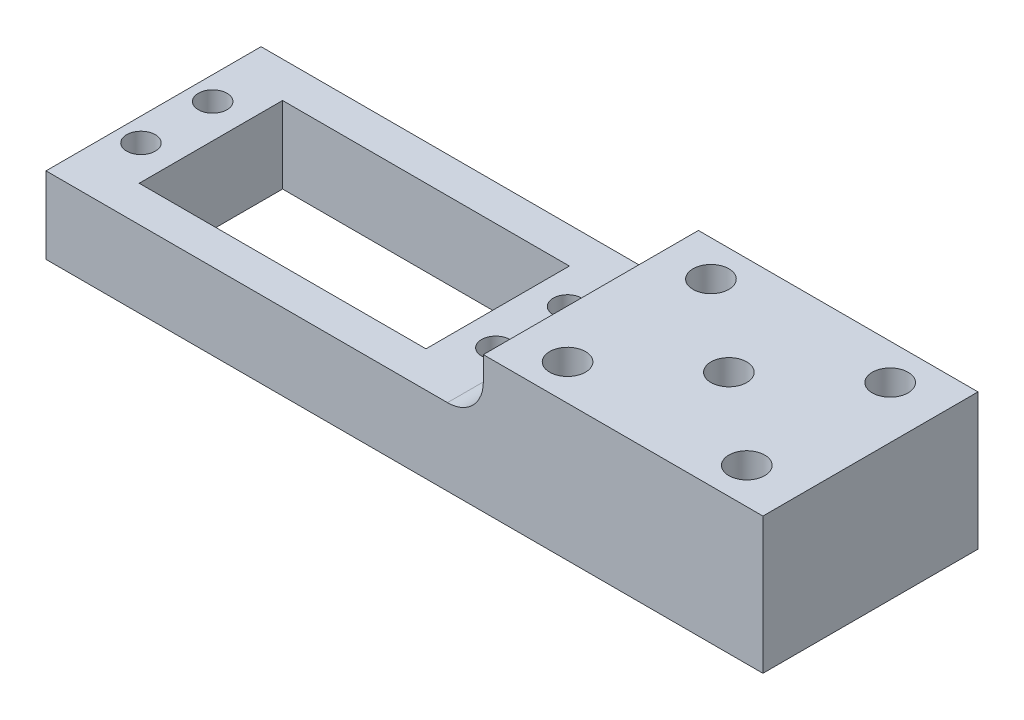
ISO-10303-21;
HEADER;
FILE_DESCRIPTION(('STEP AP214'),'2;1');
FILE_NAME('part.step','',(''),(''),'','','');
FILE_SCHEMA(('AUTOMOTIVE_DESIGN { 1 0 10303 214 1 1 1 1 }'));
ENDSEC;
DATA;
#1=APPLICATION_CONTEXT('core data for automotive mechanical design processes');
#2=APPLICATION_PROTOCOL_DEFINITION('international standard','automotive_design',2000,#1);
#3=PRODUCT_CONTEXT('',#1,'mechanical');
#4=PRODUCT('Part','Part','',(#3));
#5=PRODUCT_RELATED_PRODUCT_CATEGORY('part','',(#4));
#6=PRODUCT_DEFINITION_FORMATION('','',#4);
#7=PRODUCT_DEFINITION_CONTEXT('part definition',#1,'design');
#8=PRODUCT_DEFINITION('design','',#6,#7);
#9=PRODUCT_DEFINITION_SHAPE('','',#8);
#10=(LENGTH_UNIT() NAMED_UNIT(*) SI_UNIT(.MILLI.,.METRE.));
#11=(NAMED_UNIT(*) PLANE_ANGLE_UNIT() SI_UNIT($,.RADIAN.));
#12=(NAMED_UNIT(*) SI_UNIT($,.STERADIAN.) SOLID_ANGLE_UNIT());
#13=UNCERTAINTY_MEASURE_WITH_UNIT(LENGTH_MEASURE(1.E-05),#10,'distance_accuracy_value','');
#14=(GEOMETRIC_REPRESENTATION_CONTEXT(3) GLOBAL_UNCERTAINTY_ASSIGNED_CONTEXT((#13)) GLOBAL_UNIT_ASSIGNED_CONTEXT((#10,
#11,#12)) REPRESENTATION_CONTEXT('',''));
#15=CARTESIAN_POINT('',(0.,0.,0.));
#16=DIRECTION('',(0.,0.,1.));
#17=DIRECTION('',(1.,0.,0.));
#18=AXIS2_PLACEMENT_3D('',#15,#16,#17);
#19=CARTESIAN_POINT('',(0.,10.7,-10.));
#20=DIRECTION('',(0.,0.,-1.));
#21=DIRECTION('',(-1.,0.,0.));
#22=AXIS2_PLACEMENT_3D('',#19,#20,#21);
#23=PLANE('',#22);
#24=DIRECTION('',(1.,0.,0.));
#25=VECTOR('',#24,1.);
#26=CARTESIAN_POINT('',(0.,0.,-10.));
#27=LINE('',#26,#25);
#28=CARTESIAN_POINT('',(-20.,0.,-10.));
#29=VERTEX_POINT('',#28);
#30=CARTESIAN_POINT('',(20.,0.,-10.));
#31=VERTEX_POINT('',#30);
#32=EDGE_CURVE('E398',#29,#31,#27,.T.);
#33=ORIENTED_EDGE('',*,*,#32,.T.);
#34=DIRECTION('',(0.,-1.,0.));
#35=VECTOR('',#34,1.);
#36=CARTESIAN_POINT('',(20.,10.7,-10.));
#37=LINE('',#36,#35);
#38=CARTESIAN_POINT('',(20.,10.7,-10.));
#39=VERTEX_POINT('',#38);
#40=EDGE_CURVE('E273',#39,#31,#37,.T.);
#41=ORIENTED_EDGE('',*,*,#40,.F.);
#42=DIRECTION('',(1.,0.,0.));
#43=VECTOR('',#42,1.);
#44=CARTESIAN_POINT('',(0.,10.7,-10.));
#45=LINE('',#44,#43);
#46=CARTESIAN_POINT('',(-20.,10.7,-10.));
#47=VERTEX_POINT('',#46);
#48=EDGE_CURVE('E361',#47,#39,#45,.T.);
#49=ORIENTED_EDGE('',*,*,#48,.F.);
#50=DIRECTION('',(0.,-1.,0.));
#51=VECTOR('',#50,1.);
#52=CARTESIAN_POINT('',(-20.,10.7,-10.));
#53=LINE('',#52,#51);
#54=EDGE_CURVE('E278',#47,#29,#53,.T.);
#55=ORIENTED_EDGE('',*,*,#54,.T.);
#56=EDGE_LOOP('',(#33,#41,#49,#55));
#57=FACE_BOUND('',#56,.T.);
#58=ADVANCED_FACE('F72',(#57),#23,.F.);
#59=CARTESIAN_POINT('',(20.,10.7,0.));
#60=DIRECTION('',(1.,0.,0.));
#61=DIRECTION('',(0.,0.,-1.));
#62=AXIS2_PLACEMENT_3D('',#59,#60,#61);
#63=PLANE('',#62);
#64=DIRECTION('',(0.,0.,1.));
#65=VECTOR('',#64,1.);
#66=CARTESIAN_POINT('',(20.,0.,0.));
#67=LINE('',#66,#65);
#68=CARTESIAN_POINT('',(20.,0.,10.));
#69=VERTEX_POINT('',#68);
#70=EDGE_CURVE('E413',#31,#69,#67,.T.);
#71=ORIENTED_EDGE('',*,*,#70,.T.);
#72=DIRECTION('',(0.,-1.,0.));
#73=VECTOR('',#72,1.);
#74=CARTESIAN_POINT('',(20.,10.7,10.));
#75=LINE('',#74,#73);
#76=CARTESIAN_POINT('',(20.,10.7,10.));
#77=VERTEX_POINT('',#76);
#78=EDGE_CURVE('E379',#77,#69,#75,.T.);
#79=ORIENTED_EDGE('',*,*,#78,.F.);
#80=DIRECTION('',(0.,0.,1.));
#81=VECTOR('',#80,1.);
#82=CARTESIAN_POINT('',(20.,10.7,0.));
#83=LINE('',#82,#81);
#84=EDGE_CURVE('E365',#39,#77,#83,.T.);
#85=ORIENTED_EDGE('',*,*,#84,.F.);
#86=ORIENTED_EDGE('',*,*,#40,.T.);
#87=EDGE_LOOP('',(#71,#79,#85,#86));
#88=FACE_BOUND('',#87,.T.);
#89=ADVANCED_FACE('F447',(#88),#63,.F.);
#90=CARTESIAN_POINT('',(0.,10.7,10.));
#91=DIRECTION('',(0.,0.,-1.));
#92=DIRECTION('',(-1.,0.,0.));
#93=AXIS2_PLACEMENT_3D('',#90,#91,#92);
#94=PLANE('',#93);
#95=DIRECTION('',(1.,0.,0.));
#96=VECTOR('',#95,1.);
#97=CARTESIAN_POINT('',(0.,0.,10.));
#98=LINE('',#97,#96);
#99=CARTESIAN_POINT('',(-20.,0.,10.));
#100=VERTEX_POINT('',#99);
#101=EDGE_CURVE('E417',#100,#69,#98,.T.);
#102=ORIENTED_EDGE('',*,*,#101,.F.);
#103=DIRECTION('',(0.,-1.,0.));
#104=VECTOR('',#103,1.);
#105=CARTESIAN_POINT('',(-20.,10.7,10.));
#106=LINE('',#105,#104);
#107=CARTESIAN_POINT('',(-20.,10.7,10.));
#108=VERTEX_POINT('',#107);
#109=EDGE_CURVE('E381',#108,#100,#106,.T.);
#110=ORIENTED_EDGE('',*,*,#109,.F.);
#111=DIRECTION('',(1.,0.,0.));
#112=VECTOR('',#111,1.);
#113=CARTESIAN_POINT('',(0.,10.7,10.));
#114=LINE('',#113,#112);
#115=EDGE_CURVE('E319',#108,#77,#114,.T.);
#116=ORIENTED_EDGE('',*,*,#115,.T.);
#117=ORIENTED_EDGE('',*,*,#78,.T.);
#118=EDGE_LOOP('',(#102,#110,#116,#117));
#119=FACE_BOUND('',#118,.T.);
#120=ADVANCED_FACE('F378',(#119),#94,.T.);
#121=CARTESIAN_POINT('',(0.,10.7,-15.));
#122=DIRECTION('',(0.,0.,-1.));
#123=DIRECTION('',(-1.,0.,0.));
#124=AXIS2_PLACEMENT_3D('',#121,#122,#123);
#125=PLANE('',#124);
#126=DIRECTION('',(1.,0.,0.));
#127=VECTOR('',#126,1.);
#128=CARTESIAN_POINT('',(0.,0.,-15.));
#129=LINE('',#128,#127);
#130=CARTESIAN_POINT('',(-28.,0.,-15.));
#131=VERTEX_POINT('',#130);
#132=CARTESIAN_POINT('',(72.,0.,-15.));
#133=VERTEX_POINT('',#132);
#134=EDGE_CURVE('E178',#131,#133,#129,.T.);
#135=ORIENTED_EDGE('',*,*,#134,.F.);
#136=DIRECTION('',(0.,-1.,0.));
#137=VECTOR('',#136,1.);
#138=CARTESIAN_POINT('',(-28.,10.7,-15.));
#139=LINE('',#138,#137);
#140=CARTESIAN_POINT('',(-28.,10.7,-15.));
#141=VERTEX_POINT('',#140);
#142=EDGE_CURVE('E274',#141,#131,#139,.T.);
#143=ORIENTED_EDGE('',*,*,#142,.F.);
#144=DIRECTION('',(1.,0.,0.));
#145=VECTOR('',#144,1.);
#146=CARTESIAN_POINT('',(0.,10.7,-15.));
#147=LINE('',#146,#145);
#148=CARTESIAN_POINT('',(28.,10.7,-15.));
#149=VERTEX_POINT('',#148);
#150=EDGE_CURVE('E357',#141,#149,#147,.T.);
#151=ORIENTED_EDGE('',*,*,#150,.T.);
#152=CARTESIAN_POINT('',(28.,15.7,-15.));
#153=DIRECTION('',(0.,0.,-1.));
#154=DIRECTION('',(-1.,0.,0.));
#155=AXIS2_PLACEMENT_3D('',#152,#153,#154);
#156=CIRCLE('',#155,5.);
#157=CARTESIAN_POINT('',(33.,15.7,-15.));
#158=VERTEX_POINT('',#157);
#159=EDGE_CURVE('E13',#149,#158,#156,.F.);
#160=ORIENTED_EDGE('',*,*,#159,.T.);
#161=DIRECTION('',(0.,-1.,0.));
#162=VECTOR('',#161,1.);
#163=CARTESIAN_POINT('',(33.,19.,-15.));
#164=LINE('',#163,#162);
#165=CARTESIAN_POINT('',(33.,19.,-15.));
#166=VERTEX_POINT('',#165);
#167=EDGE_CURVE('E200',#166,#158,#164,.T.);
#168=ORIENTED_EDGE('',*,*,#167,.F.);
#169=DIRECTION('',(1.,0.,0.));
#170=VECTOR('',#169,1.);
#171=CARTESIAN_POINT('',(-28.,19.,-15.));
#172=LINE('',#171,#170);
#173=CARTESIAN_POINT('',(72.,19.,-15.));
#174=VERTEX_POINT('',#173);
#175=EDGE_CURVE('E195',#166,#174,#172,.T.);
#176=ORIENTED_EDGE('',*,*,#175,.T.);
#177=DIRECTION('',(0.,-1.,0.));
#178=VECTOR('',#177,1.);
#179=CARTESIAN_POINT('',(72.,19.,-15.));
#180=LINE('',#179,#178);
#181=EDGE_CURVE('E191',#174,#133,#180,.T.);
#182=ORIENTED_EDGE('',*,*,#181,.T.);
#183=EDGE_LOOP('',(#135,#143,#151,#160,#168,#176,#182));
#184=FACE_BOUND('',#183,.T.);
#185=ADVANCED_FACE('F192',(#184),#125,.T.);
#186=CARTESIAN_POINT('',(-28.,10.7,0.));
#187=DIRECTION('',(1.,0.,0.));
#188=DIRECTION('',(0.,0.,-1.));
#189=AXIS2_PLACEMENT_3D('',#186,#187,#188);
#190=PLANE('',#189);
#191=DIRECTION('',(0.,0.,1.));
#192=VECTOR('',#191,1.);
#193=CARTESIAN_POINT('',(-28.,0.,0.));
#194=LINE('',#193,#192);
#195=CARTESIAN_POINT('',(-28.,0.,15.));
#196=VERTEX_POINT('',#195);
#197=EDGE_CURVE('E185',#131,#196,#194,.T.);
#198=ORIENTED_EDGE('',*,*,#197,.T.);
#199=DIRECTION('',(0.,-1.,0.));
#200=VECTOR('',#199,1.);
#201=CARTESIAN_POINT('',(-28.,10.7,15.));
#202=LINE('',#201,#200);
#203=CARTESIAN_POINT('',(-28.,10.7,15.));
#204=VERTEX_POINT('',#203);
#205=EDGE_CURVE('E279',#204,#196,#202,.T.);
#206=ORIENTED_EDGE('',*,*,#205,.F.);
#207=DIRECTION('',(0.,0.,1.));
#208=VECTOR('',#207,1.);
#209=CARTESIAN_POINT('',(-28.,10.7,0.));
#210=LINE('',#209,#208);
#211=EDGE_CURVE('E351',#141,#204,#210,.T.);
#212=ORIENTED_EDGE('',*,*,#211,.F.);
#213=ORIENTED_EDGE('',*,*,#142,.T.);
#214=EDGE_LOOP('',(#198,#206,#212,#213));
#215=FACE_BOUND('',#214,.T.);
#216=ADVANCED_FACE('F459',(#215),#190,.F.);
#217=CARTESIAN_POINT('',(-20.,10.7,0.));
#218=DIRECTION('',(1.,0.,0.));
#219=DIRECTION('',(0.,0.,-1.));
#220=AXIS2_PLACEMENT_3D('',#217,#218,#219);
#221=PLANE('',#220);
#222=DIRECTION('',(0.,0.,1.));
#223=VECTOR('',#222,1.);
#224=CARTESIAN_POINT('',(-20.,0.,0.));
#225=LINE('',#224,#223);
#226=EDGE_CURVE('E390',#29,#100,#225,.T.);
#227=ORIENTED_EDGE('',*,*,#226,.F.);
#228=ORIENTED_EDGE('',*,*,#54,.F.);
#229=DIRECTION('',(0.,0.,1.));
#230=VECTOR('',#229,1.);
#231=CARTESIAN_POINT('',(-20.,10.7,0.));
#232=LINE('',#231,#230);
#233=EDGE_CURVE('E314',#47,#108,#232,.T.);
#234=ORIENTED_EDGE('',*,*,#233,.T.);
#235=ORIENTED_EDGE('',*,*,#109,.T.);
#236=EDGE_LOOP('',(#227,#228,#234,#235));
#237=FACE_BOUND('',#236,.T.);
#238=ADVANCED_FACE('F387',(#237),#221,.T.);
#239=CARTESIAN_POINT('',(0.,10.7,15.));
#240=DIRECTION('',(0.,0.,-1.));
#241=DIRECTION('',(-1.,0.,0.));
#242=AXIS2_PLACEMENT_3D('',#239,#240,#241);
#243=PLANE('',#242);
#244=DIRECTION('',(1.,0.,0.));
#245=VECTOR('',#244,1.);
#246=CARTESIAN_POINT('',(0.,0.,15.));
#247=LINE('',#246,#245);
#248=CARTESIAN_POINT('',(72.,0.,15.));
#249=VERTEX_POINT('',#248);
#250=EDGE_CURVE('E290',#196,#249,#247,.T.);
#251=ORIENTED_EDGE('',*,*,#250,.T.);
#252=DIRECTION('',(0.,-1.,0.));
#253=VECTOR('',#252,1.);
#254=CARTESIAN_POINT('',(72.,19.,15.));
#255=LINE('',#254,#253);
#256=CARTESIAN_POINT('',(72.,19.,15.));
#257=VERTEX_POINT('',#256);
#258=EDGE_CURVE('E205',#257,#249,#255,.T.);
#259=ORIENTED_EDGE('',*,*,#258,.F.);
#260=DIRECTION('',(1.,0.,0.));
#261=VECTOR('',#260,1.);
#262=CARTESIAN_POINT('',(-28.,19.,15.));
#263=LINE('',#262,#261);
#264=CARTESIAN_POINT('',(33.,19.,15.));
#265=VERTEX_POINT('',#264);
#266=EDGE_CURVE('E208',#265,#257,#263,.T.);
#267=ORIENTED_EDGE('',*,*,#266,.F.);
#268=DIRECTION('',(0.,-1.,0.));
#269=VECTOR('',#268,1.);
#270=CARTESIAN_POINT('',(33.,19.,15.));
#271=LINE('',#270,#269);
#272=CARTESIAN_POINT('',(33.,15.7,15.));
#273=VERTEX_POINT('',#272);
#274=EDGE_CURVE('E207',#265,#273,#271,.T.);
#275=ORIENTED_EDGE('',*,*,#274,.T.);
#276=CARTESIAN_POINT('',(28.,15.7,15.));
#277=DIRECTION('',(0.,0.,-1.));
#278=DIRECTION('',(-1.,0.,0.));
#279=AXIS2_PLACEMENT_3D('',#276,#277,#278);
#280=CIRCLE('',#279,5.);
#281=CARTESIAN_POINT('',(28.,10.7,15.));
#282=VERTEX_POINT('',#281);
#283=EDGE_CURVE('E81',#273,#282,#280,.T.);
#284=ORIENTED_EDGE('',*,*,#283,.T.);
#285=DIRECTION('',(1.,0.,0.));
#286=VECTOR('',#285,1.);
#287=CARTESIAN_POINT('',(0.,10.7,15.));
#288=LINE('',#287,#286);
#289=EDGE_CURVE('E356',#204,#282,#288,.T.);
#290=ORIENTED_EDGE('',*,*,#289,.F.);
#291=ORIENTED_EDGE('',*,*,#205,.T.);
#292=EDGE_LOOP('',(#251,#259,#267,#275,#284,#290,#291));
#293=FACE_BOUND('',#292,.T.);
#294=ADVANCED_FACE('F455',(#293),#243,.F.);
#295=CARTESIAN_POINT('',(24.7500000000039,10.7,-5.));
#296=DIRECTION('',(0.,-1.,0.));
#297=DIRECTION('',(0.,0.,-1.));
#298=AXIS2_PLACEMENT_3D('',#295,#296,#297);
#299=CYLINDRICAL_SURFACE('',#298,2.);
#300=CARTESIAN_POINT('',(24.7500000000039,10.7,-5.));
#301=DIRECTION('',(0.,1.,0.));
#302=DIRECTION('',(0.,0.,1.));
#303=AXIS2_PLACEMENT_3D('',#300,#301,#302);
#304=CIRCLE('',#303,2.);
#305=CARTESIAN_POINT('',(24.7500000000039,10.7,-3.));
#306=VERTEX_POINT('',#305);
#307=EDGE_CURVE('E342',#306,#306,#304,.T.);
#308=ORIENTED_EDGE('',*,*,#307,.T.);
#309=EDGE_LOOP('',(#308));
#310=FACE_BOUND('',#309,.T.);
#311=CARTESIAN_POINT('',(24.7500000000039,0.,-5.));
#312=DIRECTION('',(0.,1.,0.));
#313=DIRECTION('',(0.,0.,1.));
#314=AXIS2_PLACEMENT_3D('',#311,#312,#313);
#315=CIRCLE('',#314,2.);
#316=CARTESIAN_POINT('',(24.7500000000039,0.,-3.));
#317=VERTEX_POINT('',#316);
#318=EDGE_CURVE('E188',#317,#317,#315,.T.);
#319=ORIENTED_EDGE('',*,*,#318,.F.);
#320=EDGE_LOOP('',(#319));
#321=FACE_BOUND('',#320,.T.);
#322=ADVANCED_FACE('F458',(#310,#321),#299,.F.);
#323=CARTESIAN_POINT('',(24.7500000000039,10.7,5.));
#324=DIRECTION('',(0.,-1.,0.));
#325=DIRECTION('',(0.,0.,-1.));
#326=AXIS2_PLACEMENT_3D('',#323,#324,#325);
#327=CYLINDRICAL_SURFACE('',#326,2.);
#328=CARTESIAN_POINT('',(24.7500000000039,10.7,5.));
#329=DIRECTION('',(0.,1.,0.));
#330=DIRECTION('',(0.,0.,1.));
#331=AXIS2_PLACEMENT_3D('',#328,#329,#330);
#332=CIRCLE('',#331,2.);
#333=CARTESIAN_POINT('',(24.7500000000039,10.7,7.));
#334=VERTEX_POINT('',#333);
#335=EDGE_CURVE('E336',#334,#334,#332,.T.);
#336=ORIENTED_EDGE('',*,*,#335,.T.);
#337=EDGE_LOOP('',(#336));
#338=FACE_BOUND('',#337,.T.);
#339=CARTESIAN_POINT('',(24.7500000000039,0.,5.));
#340=DIRECTION('',(0.,1.,0.));
#341=DIRECTION('',(0.,0.,1.));
#342=AXIS2_PLACEMENT_3D('',#339,#340,#341);
#343=CIRCLE('',#342,2.);
#344=CARTESIAN_POINT('',(24.7500000000039,0.,7.));
#345=VERTEX_POINT('',#344);
#346=EDGE_CURVE('E302',#345,#345,#343,.T.);
#347=ORIENTED_EDGE('',*,*,#346,.F.);
#348=EDGE_LOOP('',(#347));
#349=FACE_BOUND('',#348,.T.);
#350=ADVANCED_FACE('F467',(#338,#349),#327,.F.);
#351=CARTESIAN_POINT('',(-24.7500000000038,10.7,5.));
#352=DIRECTION('',(0.,-1.,0.));
#353=DIRECTION('',(0.,0.,-1.));
#354=AXIS2_PLACEMENT_3D('',#351,#352,#353);
#355=CYLINDRICAL_SURFACE('',#354,2.);
#356=CARTESIAN_POINT('',(-24.7500000000038,10.7,5.));
#357=DIRECTION('',(0.,1.,0.));
#358=DIRECTION('',(0.,0.,1.));
#359=AXIS2_PLACEMENT_3D('',#356,#357,#358);
#360=CIRCLE('',#359,2.);
#361=CARTESIAN_POINT('',(-24.7500000000038,10.7,7.));
#362=VERTEX_POINT('',#361);
#363=EDGE_CURVE('E332',#362,#362,#360,.F.);
#364=ORIENTED_EDGE('',*,*,#363,.F.);
#365=EDGE_LOOP('',(#364));
#366=FACE_BOUND('',#365,.T.);
#367=CARTESIAN_POINT('',(-24.7500000000038,0.,5.));
#368=DIRECTION('',(0.,1.,0.));
#369=DIRECTION('',(0.,0.,1.));
#370=AXIS2_PLACEMENT_3D('',#367,#368,#369);
#371=CIRCLE('',#370,2.);
#372=CARTESIAN_POINT('',(-24.7500000000038,0.,7.));
#373=VERTEX_POINT('',#372);
#374=EDGE_CURVE('E254',#373,#373,#371,.F.);
#375=ORIENTED_EDGE('',*,*,#374,.T.);
#376=EDGE_LOOP('',(#375));
#377=FACE_BOUND('',#376,.T.);
#378=ADVANCED_FACE('F470',(#366,#377),#355,.F.);
#379=CARTESIAN_POINT('',(-24.7500000000038,10.7,-5.));
#380=DIRECTION('',(0.,-1.,0.));
#381=DIRECTION('',(0.,0.,-1.));
#382=AXIS2_PLACEMENT_3D('',#379,#380,#381);
#383=CYLINDRICAL_SURFACE('',#382,2.);
#384=CARTESIAN_POINT('',(-24.7500000000038,10.7,-5.));
#385=DIRECTION('',(0.,1.,0.));
#386=DIRECTION('',(0.,0.,1.));
#387=AXIS2_PLACEMENT_3D('',#384,#385,#386);
#388=CIRCLE('',#387,2.);
#389=CARTESIAN_POINT('',(-24.7500000000038,10.7,-3.));
#390=VERTEX_POINT('',#389);
#391=EDGE_CURVE('E310',#390,#390,#388,.F.);
#392=ORIENTED_EDGE('',*,*,#391,.F.);
#393=EDGE_LOOP('',(#392));
#394=FACE_BOUND('',#393,.T.);
#395=CARTESIAN_POINT('',(-24.7500000000038,0.,-5.));
#396=DIRECTION('',(0.,1.,0.));
#397=DIRECTION('',(0.,0.,1.));
#398=AXIS2_PLACEMENT_3D('',#395,#396,#397);
#399=CIRCLE('',#398,2.);
#400=CARTESIAN_POINT('',(-24.7500000000038,0.,-3.));
#401=VERTEX_POINT('',#400);
#402=EDGE_CURVE('E337',#401,#401,#399,.F.);
#403=ORIENTED_EDGE('',*,*,#402,.T.);
#404=EDGE_LOOP('',(#403));
#405=FACE_BOUND('',#404,.T.);
#406=ADVANCED_FACE('F428',(#394,#405),#383,.F.);
#407=CARTESIAN_POINT('',(0.,10.7,0.));
#408=DIRECTION('',(0.,1.,0.));
#409=DIRECTION('',(0.,0.,1.));
#410=AXIS2_PLACEMENT_3D('',#407,#408,#409);
#411=PLANE('',#410);
#412=ORIENTED_EDGE('',*,*,#363,.T.);
#413=EDGE_LOOP('',(#412));
#414=FACE_BOUND('',#413,.T.);
#415=ORIENTED_EDGE('',*,*,#335,.F.);
#416=EDGE_LOOP('',(#415));
#417=FACE_BOUND('',#416,.T.);
#418=ORIENTED_EDGE('',*,*,#307,.F.);
#419=EDGE_LOOP('',(#418));
#420=FACE_BOUND('',#419,.T.);
#421=ORIENTED_EDGE('',*,*,#289,.T.);
#422=DIRECTION('',(0.,0.,1.));
#423=VECTOR('',#422,1.);
#424=CARTESIAN_POINT('',(28.,10.7,0.));
#425=LINE('',#424,#423);
#426=EDGE_CURVE('E99',#282,#149,#425,.F.);
#427=ORIENTED_EDGE('',*,*,#426,.T.);
#428=ORIENTED_EDGE('',*,*,#150,.F.);
#429=ORIENTED_EDGE('',*,*,#211,.T.);
#430=EDGE_LOOP('',(#421,#427,#428,#429));
#431=FACE_BOUND('',#430,.T.);
#432=ORIENTED_EDGE('',*,*,#48,.T.);
#433=ORIENTED_EDGE('',*,*,#84,.T.);
#434=ORIENTED_EDGE('',*,*,#115,.F.);
#435=ORIENTED_EDGE('',*,*,#233,.F.);
#436=EDGE_LOOP('',(#432,#433,#434,#435));
#437=FACE_BOUND('',#436,.T.);
#438=ORIENTED_EDGE('',*,*,#391,.T.);
#439=EDGE_LOOP('',(#438));
#440=FACE_BOUND('',#439,.T.);
#441=ADVANCED_FACE('F383',(#414,#417,#420,#431,#437,#440),#411,.T.);
#442=CARTESIAN_POINT('',(0.,0.,0.));
#443=DIRECTION('',(0.,1.,0.));
#444=DIRECTION('',(0.,0.,1.));
#445=AXIS2_PLACEMENT_3D('',#442,#443,#444);
#446=PLANE('',#445);
#447=CARTESIAN_POINT('',(39.7500000000039,0.,-10.));
#448=DIRECTION('',(0.,-1.,0.));
#449=DIRECTION('',(0.,0.,-1.));
#450=AXIS2_PLACEMENT_3D('',#447,#448,#449);
#451=CIRCLE('',#450,2.49999999999999);
#452=CARTESIAN_POINT('',(39.7500000000039,0.,-12.5));
#453=VERTEX_POINT('',#452);
#454=EDGE_CURVE('E517',#453,#453,#451,.T.);
#455=ORIENTED_EDGE('',*,*,#454,.F.);
#456=EDGE_LOOP('',(#455));
#457=FACE_BOUND('',#456,.T.);
#458=CARTESIAN_POINT('',(64.7500000000039,0.,10.));
#459=DIRECTION('',(0.,-1.,0.));
#460=DIRECTION('',(0.,0.,-1.));
#461=AXIS2_PLACEMENT_3D('',#458,#459,#460);
#462=CIRCLE('',#461,2.49999999999999);
#463=CARTESIAN_POINT('',(64.7500000000039,0.,7.5));
#464=VERTEX_POINT('',#463);
#465=EDGE_CURVE('E513',#464,#464,#462,.T.);
#466=ORIENTED_EDGE('',*,*,#465,.F.);
#467=EDGE_LOOP('',(#466));
#468=FACE_BOUND('',#467,.T.);
#469=CARTESIAN_POINT('',(64.7500000000039,0.,-10.));
#470=DIRECTION('',(0.,-1.,0.));
#471=DIRECTION('',(0.,0.,-1.));
#472=AXIS2_PLACEMENT_3D('',#469,#470,#471);
#473=CIRCLE('',#472,2.49999999999999);
#474=CARTESIAN_POINT('',(64.7500000000039,0.,-12.5));
#475=VERTEX_POINT('',#474);
#476=EDGE_CURVE('E507',#475,#475,#473,.T.);
#477=ORIENTED_EDGE('',*,*,#476,.F.);
#478=EDGE_LOOP('',(#477));
#479=FACE_BOUND('',#478,.T.);
#480=CARTESIAN_POINT('',(52.2500000000039,0.,0.));
#481=DIRECTION('',(0.,-1.,0.));
#482=DIRECTION('',(0.,0.,-1.));
#483=AXIS2_PLACEMENT_3D('',#480,#481,#482);
#484=CIRCLE('',#483,2.5);
#485=CARTESIAN_POINT('',(52.2500000000039,0.,-2.5));
#486=VERTEX_POINT('',#485);
#487=EDGE_CURVE('E508',#486,#486,#484,.T.);
#488=ORIENTED_EDGE('',*,*,#487,.F.);
#489=EDGE_LOOP('',(#488));
#490=FACE_BOUND('',#489,.T.);
#491=CARTESIAN_POINT('',(39.7500000000039,0.,10.));
#492=DIRECTION('',(0.,-1.,0.));
#493=DIRECTION('',(0.,0.,-1.));
#494=AXIS2_PLACEMENT_3D('',#491,#492,#493);
#495=CIRCLE('',#494,2.49999999999999);
#496=CARTESIAN_POINT('',(39.7500000000039,0.,7.5));
#497=VERTEX_POINT('',#496);
#498=EDGE_CURVE('E228',#497,#497,#495,.T.);
#499=ORIENTED_EDGE('',*,*,#498,.F.);
#500=EDGE_LOOP('',(#499));
#501=FACE_BOUND('',#500,.T.);
#502=ORIENTED_EDGE('',*,*,#374,.F.);
#503=EDGE_LOOP('',(#502));
#504=FACE_BOUND('',#503,.T.);
#505=ORIENTED_EDGE('',*,*,#346,.T.);
#506=EDGE_LOOP('',(#505));
#507=FACE_BOUND('',#506,.T.);
#508=ORIENTED_EDGE('',*,*,#318,.T.);
#509=EDGE_LOOP('',(#508));
#510=FACE_BOUND('',#509,.T.);
#511=ORIENTED_EDGE('',*,*,#134,.T.);
#512=DIRECTION('',(0.,0.,1.));
#513=VECTOR('',#512,1.);
#514=CARTESIAN_POINT('',(72.,0.,-15.));
#515=LINE('',#514,#513);
#516=EDGE_CURVE('E183',#133,#249,#515,.T.);
#517=ORIENTED_EDGE('',*,*,#516,.T.);
#518=ORIENTED_EDGE('',*,*,#250,.F.);
#519=ORIENTED_EDGE('',*,*,#197,.F.);
#520=EDGE_LOOP('',(#511,#517,#518,#519));
#521=FACE_BOUND('',#520,.T.);
#522=ORIENTED_EDGE('',*,*,#32,.F.);
#523=ORIENTED_EDGE('',*,*,#226,.T.);
#524=ORIENTED_EDGE('',*,*,#101,.T.);
#525=ORIENTED_EDGE('',*,*,#70,.F.);
#526=EDGE_LOOP('',(#522,#523,#524,#525));
#527=FACE_BOUND('',#526,.T.);
#528=ORIENTED_EDGE('',*,*,#402,.F.);
#529=EDGE_LOOP('',(#528));
#530=FACE_BOUND('',#529,.T.);
#531=ADVANCED_FACE('F180',(#457,#468,#479,#490,#501,#504,#507,#510,#521,#527,#530),#446,.F.);
#532=CARTESIAN_POINT('',(33.,19.,0.));
#533=DIRECTION('',(1.,0.,0.));
#534=DIRECTION('',(0.,0.,-1.));
#535=AXIS2_PLACEMENT_3D('',#532,#533,#534);
#536=PLANE('',#535);
#537=ORIENTED_EDGE('',*,*,#167,.T.);
#538=DIRECTION('',(0.,0.,1.));
#539=VECTOR('',#538,1.);
#540=CARTESIAN_POINT('',(33.,15.7,0.));
#541=LINE('',#540,#539);
#542=EDGE_CURVE('E269',#158,#273,#541,.T.);
#543=ORIENTED_EDGE('',*,*,#542,.T.);
#544=ORIENTED_EDGE('',*,*,#274,.F.);
#545=DIRECTION('',(0.,0.,1.));
#546=VECTOR('',#545,1.);
#547=CARTESIAN_POINT('',(33.,19.,0.));
#548=LINE('',#547,#546);
#549=EDGE_CURVE('E216',#166,#265,#548,.T.);
#550=ORIENTED_EDGE('',*,*,#549,.F.);
#551=EDGE_LOOP('',(#537,#543,#544,#550));
#552=FACE_BOUND('',#551,.T.);
#553=ADVANCED_FACE('F431',(#552),#536,.F.);
#554=CARTESIAN_POINT('',(0.,19.,0.));
#555=DIRECTION('',(0.,-1.,0.));
#556=DIRECTION('',(0.,0.,-1.));
#557=AXIS2_PLACEMENT_3D('',#554,#555,#556);
#558=PLANE('',#557);
#559=CARTESIAN_POINT('',(39.7500000000039,19.,-10.));
#560=DIRECTION('',(0.,-1.,0.));
#561=DIRECTION('',(0.,0.,-1.));
#562=AXIS2_PLACEMENT_3D('',#559,#560,#561);
#563=CIRCLE('',#562,2.49999999999999);
#564=CARTESIAN_POINT('',(39.7500000000039,19.,-12.5));
#565=VERTEX_POINT('',#564);
#566=EDGE_CURVE('E234',#565,#565,#563,.F.);
#567=ORIENTED_EDGE('',*,*,#566,.F.);
#568=EDGE_LOOP('',(#567));
#569=FACE_BOUND('',#568,.T.);
#570=CARTESIAN_POINT('',(64.7500000000039,19.,10.));
#571=DIRECTION('',(0.,-1.,0.));
#572=DIRECTION('',(0.,0.,-1.));
#573=AXIS2_PLACEMENT_3D('',#570,#571,#572);
#574=CIRCLE('',#573,2.49999999999999);
#575=CARTESIAN_POINT('',(64.7500000000039,19.,7.5));
#576=VERTEX_POINT('',#575);
#577=EDGE_CURVE('E235',#576,#576,#574,.F.);
#578=ORIENTED_EDGE('',*,*,#577,.F.);
#579=EDGE_LOOP('',(#578));
#580=FACE_BOUND('',#579,.T.);
#581=CARTESIAN_POINT('',(64.7500000000039,19.,-10.));
#582=DIRECTION('',(0.,-1.,0.));
#583=DIRECTION('',(0.,0.,-1.));
#584=AXIS2_PLACEMENT_3D('',#581,#582,#583);
#585=CIRCLE('',#584,2.49999999999999);
#586=CARTESIAN_POINT('',(64.7500000000039,19.,-12.5));
#587=VERTEX_POINT('',#586);
#588=EDGE_CURVE('E510',#587,#587,#585,.F.);
#589=ORIENTED_EDGE('',*,*,#588,.F.);
#590=EDGE_LOOP('',(#589));
#591=FACE_BOUND('',#590,.T.);
#592=CARTESIAN_POINT('',(52.2500000000039,19.,0.));
#593=DIRECTION('',(0.,-1.,0.));
#594=DIRECTION('',(0.,0.,-1.));
#595=AXIS2_PLACEMENT_3D('',#592,#593,#594);
#596=CIRCLE('',#595,2.5);
#597=CARTESIAN_POINT('',(52.2500000000039,19.,-2.5));
#598=VERTEX_POINT('',#597);
#599=EDGE_CURVE('E504',#598,#598,#596,.F.);
#600=ORIENTED_EDGE('',*,*,#599,.F.);
#601=EDGE_LOOP('',(#600));
#602=FACE_BOUND('',#601,.T.);
#603=CARTESIAN_POINT('',(39.7500000000039,19.,10.));
#604=DIRECTION('',(0.,-1.,0.));
#605=DIRECTION('',(0.,0.,-1.));
#606=AXIS2_PLACEMENT_3D('',#603,#604,#605);
#607=CIRCLE('',#606,2.49999999999999);
#608=CARTESIAN_POINT('',(39.7500000000039,19.,7.5));
#609=VERTEX_POINT('',#608);
#610=EDGE_CURVE('E233',#609,#609,#607,.F.);
#611=ORIENTED_EDGE('',*,*,#610,.F.);
#612=EDGE_LOOP('',(#611));
#613=FACE_BOUND('',#612,.T.);
#614=ORIENTED_EDGE('',*,*,#175,.F.);
#615=ORIENTED_EDGE('',*,*,#549,.T.);
#616=ORIENTED_EDGE('',*,*,#266,.T.);
#617=DIRECTION('',(0.,0.,1.));
#618=VECTOR('',#617,1.);
#619=CARTESIAN_POINT('',(72.,19.,-15.));
#620=LINE('',#619,#618);
#621=EDGE_CURVE('E213',#174,#257,#620,.T.);
#622=ORIENTED_EDGE('',*,*,#621,.F.);
#623=EDGE_LOOP('',(#614,#615,#616,#622));
#624=FACE_BOUND('',#623,.T.);
#625=ADVANCED_FACE('F438',(#569,#580,#591,#602,#613,#624),#558,.F.);
#626=CARTESIAN_POINT('',(72.,19.,-15.));
#627=DIRECTION('',(1.,0.,0.));
#628=DIRECTION('',(0.,0.,-1.));
#629=AXIS2_PLACEMENT_3D('',#626,#627,#628);
#630=PLANE('',#629);
#631=ORIENTED_EDGE('',*,*,#516,.F.);
#632=ORIENTED_EDGE('',*,*,#181,.F.);
#633=ORIENTED_EDGE('',*,*,#621,.T.);
#634=ORIENTED_EDGE('',*,*,#258,.T.);
#635=EDGE_LOOP('',(#631,#632,#633,#634));
#636=FACE_BOUND('',#635,.T.);
#637=ADVANCED_FACE('F203',(#636),#630,.T.);
#638=CARTESIAN_POINT('',(28.,15.7,0.));
#639=DIRECTION('',(0.,0.,1.));
#640=DIRECTION('',(1.,0.,0.));
#641=AXIS2_PLACEMENT_3D('',#638,#639,#640);
#642=CYLINDRICAL_SURFACE('',#641,5.);
#643=ORIENTED_EDGE('',*,*,#159,.F.);
#644=ORIENTED_EDGE('',*,*,#426,.F.);
#645=ORIENTED_EDGE('',*,*,#283,.F.);
#646=ORIENTED_EDGE('',*,*,#542,.F.);
#647=EDGE_LOOP('',(#643,#644,#645,#646));
#648=FACE_BOUND('',#647,.T.);
#649=ADVANCED_FACE('F74',(#648),#642,.F.);
#650=CARTESIAN_POINT('',(39.7500000000039,19.001,10.));
#651=DIRECTION('',(0.,-1.,0.));
#652=DIRECTION('',(0.,0.,-1.));
#653=AXIS2_PLACEMENT_3D('',#650,#651,#652);
#654=CYLINDRICAL_SURFACE('',#653,2.49999999999999);
#655=ORIENTED_EDGE('',*,*,#498,.T.);
#656=EDGE_LOOP('',(#655));
#657=FACE_BOUND('',#656,.T.);
#658=ORIENTED_EDGE('',*,*,#610,.T.);
#659=EDGE_LOOP('',(#658));
#660=FACE_BOUND('',#659,.T.);
#661=ADVANCED_FACE('F543',(#657,#660),#654,.F.);
#662=CARTESIAN_POINT('',(52.2500000000039,19.001,0.));
#663=DIRECTION('',(0.,-1.,0.));
#664=DIRECTION('',(0.,0.,-1.));
#665=AXIS2_PLACEMENT_3D('',#662,#663,#664);
#666=CYLINDRICAL_SURFACE('',#665,2.5);
#667=ORIENTED_EDGE('',*,*,#487,.T.);
#668=EDGE_LOOP('',(#667));
#669=FACE_BOUND('',#668,.T.);
#670=ORIENTED_EDGE('',*,*,#599,.T.);
#671=EDGE_LOOP('',(#670));
#672=FACE_BOUND('',#671,.T.);
#673=ADVANCED_FACE('F537',(#669,#672),#666,.F.);
#674=CARTESIAN_POINT('',(64.7500000000039,19.001,-10.));
#675=DIRECTION('',(0.,-1.,0.));
#676=DIRECTION('',(0.,0.,-1.));
#677=AXIS2_PLACEMENT_3D('',#674,#675,#676);
#678=CYLINDRICAL_SURFACE('',#677,2.49999999999999);
#679=ORIENTED_EDGE('',*,*,#476,.T.);
#680=EDGE_LOOP('',(#679));
#681=FACE_BOUND('',#680,.T.);
#682=ORIENTED_EDGE('',*,*,#588,.T.);
#683=EDGE_LOOP('',(#682));
#684=FACE_BOUND('',#683,.T.);
#685=ADVANCED_FACE('F562',(#681,#684),#678,.F.);
#686=CARTESIAN_POINT('',(64.7500000000039,19.001,10.));
#687=DIRECTION('',(0.,-1.,0.));
#688=DIRECTION('',(0.,0.,-1.));
#689=AXIS2_PLACEMENT_3D('',#686,#687,#688);
#690=CYLINDRICAL_SURFACE('',#689,2.49999999999999);
#691=ORIENTED_EDGE('',*,*,#465,.T.);
#692=EDGE_LOOP('',(#691));
#693=FACE_BOUND('',#692,.T.);
#694=ORIENTED_EDGE('',*,*,#577,.T.);
#695=EDGE_LOOP('',(#694));
#696=FACE_BOUND('',#695,.T.);
#697=ADVANCED_FACE('F558',(#693,#696),#690,.F.);
#698=CARTESIAN_POINT('',(39.7500000000039,19.001,-10.));
#699=DIRECTION('',(0.,-1.,0.));
#700=DIRECTION('',(0.,0.,-1.));
#701=AXIS2_PLACEMENT_3D('',#698,#699,#700);
#702=CYLINDRICAL_SURFACE('',#701,2.49999999999999);
#703=ORIENTED_EDGE('',*,*,#454,.T.);
#704=EDGE_LOOP('',(#703));
#705=FACE_BOUND('',#704,.T.);
#706=ORIENTED_EDGE('',*,*,#566,.T.);
#707=EDGE_LOOP('',(#706));
#708=FACE_BOUND('',#707,.T.);
#709=ADVANCED_FACE('F561',(#705,#708),#702,.F.);
#710=CLOSED_SHELL('',(#58,#89,#120,#185,#216,#238,#294,#322,#350,#378,#406,#441,#531,#553,#625,
#637,#649,#661,#673,#685,#697,#709));
#711=MANIFOLD_SOLID_BREP('B2',#710);
#712=ADVANCED_BREP_SHAPE_REPRESENTATION('',(#18,#711),#14);
#713=SHAPE_DEFINITION_REPRESENTATION(#9,#712);
ENDSEC;
END-ISO-10303-21;
